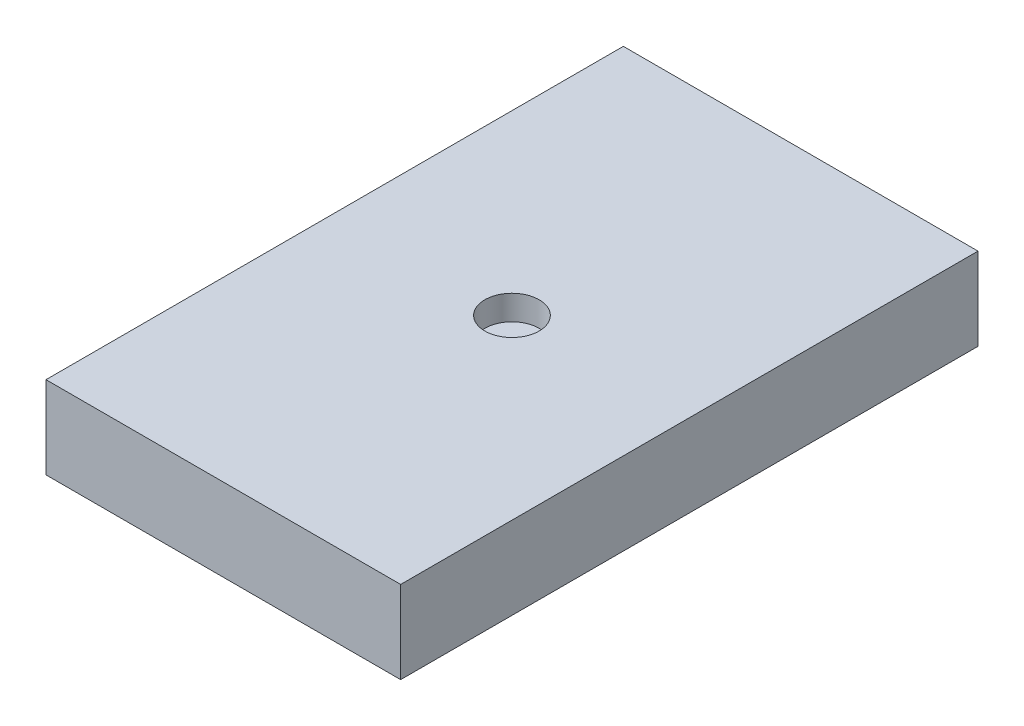
ISO-10303-21;
HEADER;
FILE_DESCRIPTION(('STEP AP214'),'2;1');
FILE_NAME('part.step','',(''),(''),'','','');
FILE_SCHEMA(('AUTOMOTIVE_DESIGN { 1 0 10303 214 1 1 1 1 }'));
ENDSEC;
DATA;
#1=APPLICATION_CONTEXT('core data for automotive mechanical design processes');
#2=APPLICATION_PROTOCOL_DEFINITION('international standard','automotive_design',2000,#1);
#3=PRODUCT_CONTEXT('',#1,'mechanical');
#4=PRODUCT('Part','Part','',(#3));
#5=PRODUCT_RELATED_PRODUCT_CATEGORY('part','',(#4));
#6=PRODUCT_DEFINITION_FORMATION('','',#4);
#7=PRODUCT_DEFINITION_CONTEXT('part definition',#1,'design');
#8=PRODUCT_DEFINITION('design','',#6,#7);
#9=PRODUCT_DEFINITION_SHAPE('','',#8);
#10=(LENGTH_UNIT() NAMED_UNIT(*) SI_UNIT(.MILLI.,.METRE.));
#11=(NAMED_UNIT(*) PLANE_ANGLE_UNIT() SI_UNIT($,.RADIAN.));
#12=(NAMED_UNIT(*) SI_UNIT($,.STERADIAN.) SOLID_ANGLE_UNIT());
#13=UNCERTAINTY_MEASURE_WITH_UNIT(LENGTH_MEASURE(1.E-05),#10,'distance_accuracy_value','');
#14=(GEOMETRIC_REPRESENTATION_CONTEXT(3) GLOBAL_UNCERTAINTY_ASSIGNED_CONTEXT((#13)) GLOBAL_UNIT_ASSIGNED_CONTEXT((#10,
#11,#12)) REPRESENTATION_CONTEXT('',''));
#15=CARTESIAN_POINT('',(0.,0.,0.));
#16=DIRECTION('',(0.,0.,1.));
#17=DIRECTION('',(1.,0.,0.));
#18=AXIS2_PLACEMENT_3D('',#15,#16,#17);
#19=CARTESIAN_POINT('',(5.461,2.54,8.89));
#20=DIRECTION('',(-1.,0.,0.));
#21=DIRECTION('',(0.,0.,1.));
#22=AXIS2_PLACEMENT_3D('',#19,#20,#21);
#23=PLANE('',#22);
#24=DIRECTION('',(0.,0.,-1.));
#25=VECTOR('',#24,1.);
#26=CARTESIAN_POINT('',(5.461,0.,8.89));
#27=LINE('',#26,#25);
#28=CARTESIAN_POINT('',(5.461,0.,8.89));
#29=VERTEX_POINT('',#28);
#30=CARTESIAN_POINT('',(5.461,0.,-8.89));
#31=VERTEX_POINT('',#30);
#32=EDGE_CURVE('E96',#29,#31,#27,.T.);
#33=ORIENTED_EDGE('',*,*,#32,.T.);
#34=DIRECTION('',(0.,-1.,0.));
#35=VECTOR('',#34,1.);
#36=CARTESIAN_POINT('',(5.461,2.54,-8.89));
#37=LINE('',#36,#35);
#38=CARTESIAN_POINT('',(5.461,2.54,-8.89));
#39=VERTEX_POINT('',#38);
#40=EDGE_CURVE('E11',#39,#31,#37,.T.);
#41=ORIENTED_EDGE('',*,*,#40,.F.);
#42=DIRECTION('',(0.,0.,-1.));
#43=VECTOR('',#42,1.);
#44=CARTESIAN_POINT('',(5.461,2.54,8.89));
#45=LINE('',#44,#43);
#46=CARTESIAN_POINT('',(5.461,2.54,8.89));
#47=VERTEX_POINT('',#46);
#48=EDGE_CURVE('E84',#47,#39,#45,.T.);
#49=ORIENTED_EDGE('',*,*,#48,.F.);
#50=DIRECTION('',(0.,-1.,0.));
#51=VECTOR('',#50,1.);
#52=CARTESIAN_POINT('',(5.461,2.54,8.89));
#53=LINE('',#52,#51);
#54=EDGE_CURVE('E92',#47,#29,#53,.T.);
#55=ORIENTED_EDGE('',*,*,#54,.T.);
#56=EDGE_LOOP('',(#33,#41,#49,#55));
#57=FACE_BOUND('',#56,.T.);
#58=ADVANCED_FACE('F33',(#57),#23,.F.);
#59=CARTESIAN_POINT('',(-5.461,2.54,-8.89));
#60=DIRECTION('',(0.,0.,1.));
#61=DIRECTION('',(1.,0.,0.));
#62=AXIS2_PLACEMENT_3D('',#59,#60,#61);
#63=PLANE('',#62);
#64=DIRECTION('',(-1.,0.,0.));
#65=VECTOR('',#64,1.);
#66=CARTESIAN_POINT('',(-5.461,0.,-8.89));
#67=LINE('',#66,#65);
#68=CARTESIAN_POINT('',(-5.461,0.,-8.89));
#69=VERTEX_POINT('',#68);
#70=EDGE_CURVE('E88',#31,#69,#67,.T.);
#71=ORIENTED_EDGE('',*,*,#70,.T.);
#72=DIRECTION('',(0.,-1.,0.));
#73=VECTOR('',#72,1.);
#74=CARTESIAN_POINT('',(-5.461,2.54,-8.89));
#75=LINE('',#74,#73);
#76=CARTESIAN_POINT('',(-5.461,2.54,-8.89));
#77=VERTEX_POINT('',#76);
#78=EDGE_CURVE('E41',#77,#69,#75,.T.);
#79=ORIENTED_EDGE('',*,*,#78,.F.);
#80=DIRECTION('',(-1.,0.,0.));
#81=VECTOR('',#80,1.);
#82=CARTESIAN_POINT('',(-5.461,2.54,-8.89));
#83=LINE('',#82,#81);
#84=EDGE_CURVE('E79',#39,#77,#83,.T.);
#85=ORIENTED_EDGE('',*,*,#84,.F.);
#86=ORIENTED_EDGE('',*,*,#40,.T.);
#87=EDGE_LOOP('',(#71,#79,#85,#86));
#88=FACE_BOUND('',#87,.T.);
#89=ADVANCED_FACE('F87',(#88),#63,.F.);
#90=CARTESIAN_POINT('',(-5.461,2.54,8.89));
#91=DIRECTION('',(1.,0.,0.));
#92=DIRECTION('',(0.,0.,-1.));
#93=AXIS2_PLACEMENT_3D('',#90,#91,#92);
#94=PLANE('',#93);
#95=DIRECTION('',(0.,0.,1.));
#96=VECTOR('',#95,1.);
#97=CARTESIAN_POINT('',(-5.461,0.,8.89));
#98=LINE('',#97,#96);
#99=CARTESIAN_POINT('',(-5.461,0.,8.89));
#100=VERTEX_POINT('',#99);
#101=EDGE_CURVE('E66',#69,#100,#98,.T.);
#102=ORIENTED_EDGE('',*,*,#101,.T.);
#103=DIRECTION('',(0.,-1.,0.));
#104=VECTOR('',#103,1.);
#105=CARTESIAN_POINT('',(-5.461,2.54,8.89));
#106=LINE('',#105,#104);
#107=CARTESIAN_POINT('',(-5.461,2.54,8.89));
#108=VERTEX_POINT('',#107);
#109=EDGE_CURVE('E89',#108,#100,#106,.T.);
#110=ORIENTED_EDGE('',*,*,#109,.F.);
#111=DIRECTION('',(0.,0.,1.));
#112=VECTOR('',#111,1.);
#113=CARTESIAN_POINT('',(-5.461,2.54,8.89));
#114=LINE('',#113,#112);
#115=EDGE_CURVE('E82',#77,#108,#114,.T.);
#116=ORIENTED_EDGE('',*,*,#115,.F.);
#117=ORIENTED_EDGE('',*,*,#78,.T.);
#118=EDGE_LOOP('',(#102,#110,#116,#117));
#119=FACE_BOUND('',#118,.T.);
#120=ADVANCED_FACE('F90',(#119),#94,.F.);
#121=CARTESIAN_POINT('',(-5.461,2.54,8.89));
#122=DIRECTION('',(0.,0.,-1.));
#123=DIRECTION('',(-1.,0.,0.));
#124=AXIS2_PLACEMENT_3D('',#121,#122,#123);
#125=PLANE('',#124);
#126=DIRECTION('',(1.,0.,0.));
#127=VECTOR('',#126,1.);
#128=CARTESIAN_POINT('',(-5.461,0.,8.89));
#129=LINE('',#128,#127);
#130=EDGE_CURVE('E72',#100,#29,#129,.T.);
#131=ORIENTED_EDGE('',*,*,#130,.T.);
#132=ORIENTED_EDGE('',*,*,#54,.F.);
#133=DIRECTION('',(1.,0.,0.));
#134=VECTOR('',#133,1.);
#135=CARTESIAN_POINT('',(-5.461,2.54,8.89));
#136=LINE('',#135,#134);
#137=EDGE_CURVE('E49',#108,#47,#136,.T.);
#138=ORIENTED_EDGE('',*,*,#137,.F.);
#139=ORIENTED_EDGE('',*,*,#109,.T.);
#140=EDGE_LOOP('',(#131,#132,#138,#139));
#141=FACE_BOUND('',#140,.T.);
#142=ADVANCED_FACE('F104',(#141),#125,.F.);
#143=CARTESIAN_POINT('',(0.,2.54,0.));
#144=DIRECTION('',(0.,-1.,0.));
#145=DIRECTION('',(0.,0.,-1.));
#146=AXIS2_PLACEMENT_3D('',#143,#144,#145);
#147=PLANE('',#146);
#148=CARTESIAN_POINT('',(0.,2.54,0.));
#149=DIRECTION('',(0.,1.,0.));
#150=DIRECTION('',(0.,0.,1.));
#151=AXIS2_PLACEMENT_3D('',#148,#149,#150);
#152=CIRCLE('',#151,0.835790113001167);
#153=CARTESIAN_POINT('',(0.,2.54,0.835790113001167));
#154=VERTEX_POINT('',#153);
#155=EDGE_CURVE('E110',#154,#154,#152,.T.);
#156=ORIENTED_EDGE('',*,*,#155,.F.);
#157=EDGE_LOOP('',(#156));
#158=FACE_BOUND('',#157,.T.);
#159=ORIENTED_EDGE('',*,*,#48,.T.);
#160=ORIENTED_EDGE('',*,*,#84,.T.);
#161=ORIENTED_EDGE('',*,*,#115,.T.);
#162=ORIENTED_EDGE('',*,*,#137,.T.);
#163=EDGE_LOOP('',(#159,#160,#161,#162));
#164=FACE_BOUND('',#163,.T.);
#165=ADVANCED_FACE('F80',(#158,#164),#147,.F.);
#166=CARTESIAN_POINT('',(0.,0.,0.));
#167=DIRECTION('',(0.,-1.,0.));
#168=DIRECTION('',(0.,0.,-1.));
#169=AXIS2_PLACEMENT_3D('',#166,#167,#168);
#170=PLANE('',#169);
#171=ORIENTED_EDGE('',*,*,#32,.F.);
#172=ORIENTED_EDGE('',*,*,#130,.F.);
#173=ORIENTED_EDGE('',*,*,#101,.F.);
#174=ORIENTED_EDGE('',*,*,#70,.F.);
#175=EDGE_LOOP('',(#171,#172,#173,#174));
#176=FACE_BOUND('',#175,.T.);
#177=ADVANCED_FACE('F107',(#176),#170,.T.);
#178=CARTESIAN_POINT('',(0.,1.778,0.));
#179=DIRECTION('',(0.,1.,0.));
#180=DIRECTION('',(0.,0.,1.));
#181=AXIS2_PLACEMENT_3D('',#178,#179,#180);
#182=CYLINDRICAL_SURFACE('',#181,0.835790113001167);
#183=CARTESIAN_POINT('',(0.,1.778,0.));
#184=DIRECTION('',(0.,1.,0.));
#185=DIRECTION('',(0.,0.,1.));
#186=AXIS2_PLACEMENT_3D('',#183,#184,#185);
#187=CIRCLE('',#186,0.835790113001167);
#188=CARTESIAN_POINT('',(0.,1.778,0.835790113001167));
#189=VERTEX_POINT('',#188);
#190=EDGE_CURVE('E99',#189,#189,#187,.T.);
#191=ORIENTED_EDGE('',*,*,#190,.F.);
#192=EDGE_LOOP('',(#191));
#193=FACE_BOUND('',#192,.T.);
#194=ORIENTED_EDGE('',*,*,#155,.T.);
#195=EDGE_LOOP('',(#194));
#196=FACE_BOUND('',#195,.T.);
#197=ADVANCED_FACE('F118',(#193,#196),#182,.F.);
#198=CARTESIAN_POINT('',(0.,1.778,0.));
#199=DIRECTION('',(0.,1.,0.));
#200=DIRECTION('',(0.,0.,1.));
#201=AXIS2_PLACEMENT_3D('',#198,#199,#200);
#202=PLANE('',#201);
#203=ORIENTED_EDGE('',*,*,#190,.T.);
#204=EDGE_LOOP('',(#203));
#205=FACE_BOUND('',#204,.T.);
#206=ADVANCED_FACE('F116',(#205),#202,.T.);
#207=CLOSED_SHELL('',(#58,#89,#120,#142,#165,#177,#197,#206));
#208=MANIFOLD_SOLID_BREP('B2',#207);
#209=ADVANCED_BREP_SHAPE_REPRESENTATION('',(#18,#208),#14);
#210=SHAPE_DEFINITION_REPRESENTATION(#9,#209);
ENDSEC;
END-ISO-10303-21;
